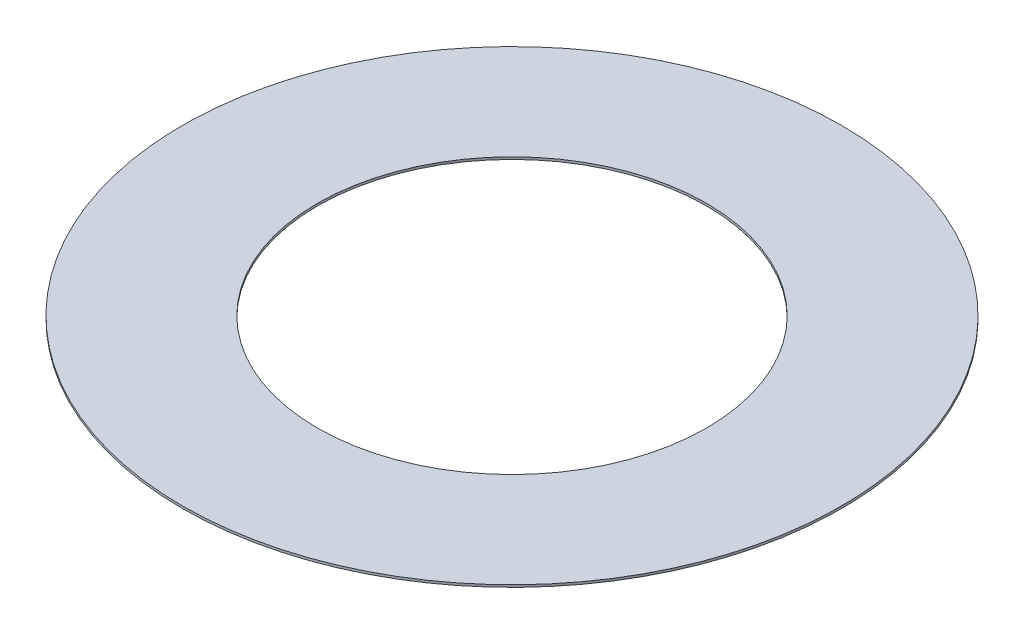
ISO-10303-21;
HEADER;
FILE_DESCRIPTION(('STEP AP214'),'2;1');
FILE_NAME('part.step','',(''),(''),'','','');
FILE_SCHEMA(('AUTOMOTIVE_DESIGN { 1 0 10303 214 1 1 1 1 }'));
ENDSEC;
DATA;
#1=APPLICATION_CONTEXT('core data for automotive mechanical design processes');
#2=APPLICATION_PROTOCOL_DEFINITION('international standard','automotive_design',2000,#1);
#3=PRODUCT_CONTEXT('',#1,'mechanical');
#4=PRODUCT('Part','Part','',(#3));
#5=PRODUCT_RELATED_PRODUCT_CATEGORY('part','',(#4));
#6=PRODUCT_DEFINITION_FORMATION('','',#4);
#7=PRODUCT_DEFINITION_CONTEXT('part definition',#1,'design');
#8=PRODUCT_DEFINITION('design','',#6,#7);
#9=PRODUCT_DEFINITION_SHAPE('','',#8);
#10=(LENGTH_UNIT() NAMED_UNIT(*) SI_UNIT(.MILLI.,.METRE.));
#11=(NAMED_UNIT(*) PLANE_ANGLE_UNIT() SI_UNIT($,.RADIAN.));
#12=(NAMED_UNIT(*) SI_UNIT($,.STERADIAN.) SOLID_ANGLE_UNIT());
#13=UNCERTAINTY_MEASURE_WITH_UNIT(LENGTH_MEASURE(1.E-05),#10,'distance_accuracy_value','');
#14=(GEOMETRIC_REPRESENTATION_CONTEXT(3) GLOBAL_UNCERTAINTY_ASSIGNED_CONTEXT((#13)) GLOBAL_UNIT_ASSIGNED_CONTEXT((#10,
#11,#12)) REPRESENTATION_CONTEXT('',''));
#15=CARTESIAN_POINT('',(0.,0.,0.));
#16=DIRECTION('',(0.,0.,1.));
#17=DIRECTION('',(1.,0.,0.));
#18=AXIS2_PLACEMENT_3D('',#15,#16,#17);
#19=CARTESIAN_POINT('',(0.,0.0889,0.));
#20=DIRECTION('',(0.,1.,0.));
#21=DIRECTION('',(0.,0.,1.));
#22=AXIS2_PLACEMENT_3D('',#19,#20,#21);
#23=PLANE('',#22);
#24=CARTESIAN_POINT('',(0.,0.0889,0.));
#25=DIRECTION('',(0.,1.,0.));
#26=DIRECTION('',(0.,0.,1.));
#27=AXIS2_PLACEMENT_3D('',#24,#25,#26);
#28=CIRCLE('',#27,25.4);
#29=CARTESIAN_POINT('',(0.,0.0889,25.4));
#30=VERTEX_POINT('',#29);
#31=EDGE_CURVE('E10',#30,#30,#28,.T.);
#32=ORIENTED_EDGE('',*,*,#31,.T.);
#33=EDGE_LOOP('',(#32));
#34=FACE_BOUND('',#33,.T.);
#35=CARTESIAN_POINT('',(0.,0.0889,0.));
#36=DIRECTION('',(0.,1.,0.));
#37=DIRECTION('',(0.,0.,1.));
#38=AXIS2_PLACEMENT_3D('',#35,#36,#37);
#39=CIRCLE('',#38,14.9987);
#40=CARTESIAN_POINT('',(0.,0.0889,14.9987));
#41=VERTEX_POINT('',#40);
#42=EDGE_CURVE('E54',#41,#41,#39,.T.);
#43=ORIENTED_EDGE('',*,*,#42,.F.);
#44=EDGE_LOOP('',(#43));
#45=FACE_BOUND('',#44,.T.);
#46=ADVANCED_FACE('F41',(#34,#45),#23,.T.);
#47=CARTESIAN_POINT('',(0.,-0.0889,0.));
#48=DIRECTION('',(0.,1.,0.));
#49=DIRECTION('',(0.,0.,1.));
#50=AXIS2_PLACEMENT_3D('',#47,#48,#49);
#51=PLANE('',#50);
#52=CARTESIAN_POINT('',(0.,-0.0889,0.));
#53=DIRECTION('',(0.,1.,0.));
#54=DIRECTION('',(0.,0.,1.));
#55=AXIS2_PLACEMENT_3D('',#52,#53,#54);
#56=CIRCLE('',#55,25.4);
#57=CARTESIAN_POINT('',(0.,-0.0889,25.4));
#58=VERTEX_POINT('',#57);
#59=EDGE_CURVE('E45',#58,#58,#56,.T.);
#60=ORIENTED_EDGE('',*,*,#59,.F.);
#61=EDGE_LOOP('',(#60));
#62=FACE_BOUND('',#61,.T.);
#63=CARTESIAN_POINT('',(0.,-0.0889,0.));
#64=DIRECTION('',(0.,1.,0.));
#65=DIRECTION('',(0.,0.,1.));
#66=AXIS2_PLACEMENT_3D('',#63,#64,#65);
#67=CIRCLE('',#66,14.9987);
#68=CARTESIAN_POINT('',(0.,-0.0889,14.9987));
#69=VERTEX_POINT('',#68);
#70=EDGE_CURVE('E56',#69,#69,#67,.T.);
#71=ORIENTED_EDGE('',*,*,#70,.T.);
#72=EDGE_LOOP('',(#71));
#73=FACE_BOUND('',#72,.T.);
#74=ADVANCED_FACE('F68',(#62,#73),#51,.F.);
#75=CARTESIAN_POINT('',(0.,0.0889,0.));
#76=DIRECTION('',(0.,-1.,0.));
#77=DIRECTION('',(0.,0.,-1.));
#78=AXIS2_PLACEMENT_3D('',#75,#76,#77);
#79=CYLINDRICAL_SURFACE('',#78,25.4);
#80=ORIENTED_EDGE('',*,*,#31,.F.);
#81=EDGE_LOOP('',(#80));
#82=FACE_BOUND('',#81,.T.);
#83=ORIENTED_EDGE('',*,*,#59,.T.);
#84=EDGE_LOOP('',(#83));
#85=FACE_BOUND('',#84,.T.);
#86=ADVANCED_FACE('F43',(#82,#85),#79,.T.);
#87=CARTESIAN_POINT('',(0.,0.0889,0.));
#88=DIRECTION('',(0.,-1.,0.));
#89=DIRECTION('',(0.,0.,-1.));
#90=AXIS2_PLACEMENT_3D('',#87,#88,#89);
#91=CYLINDRICAL_SURFACE('',#90,14.9987);
#92=ORIENTED_EDGE('',*,*,#42,.T.);
#93=EDGE_LOOP('',(#92));
#94=FACE_BOUND('',#93,.T.);
#95=ORIENTED_EDGE('',*,*,#70,.F.);
#96=EDGE_LOOP('',(#95));
#97=FACE_BOUND('',#96,.T.);
#98=ADVANCED_FACE('F64',(#94,#97),#91,.F.);
#99=CLOSED_SHELL('',(#46,#74,#86,#98));
#100=MANIFOLD_SOLID_BREP('B2',#99);
#101=ADVANCED_BREP_SHAPE_REPRESENTATION('',(#18,#100),#14);
#102=SHAPE_DEFINITION_REPRESENTATION(#9,#101);
ENDSEC;
END-ISO-10303-21;
